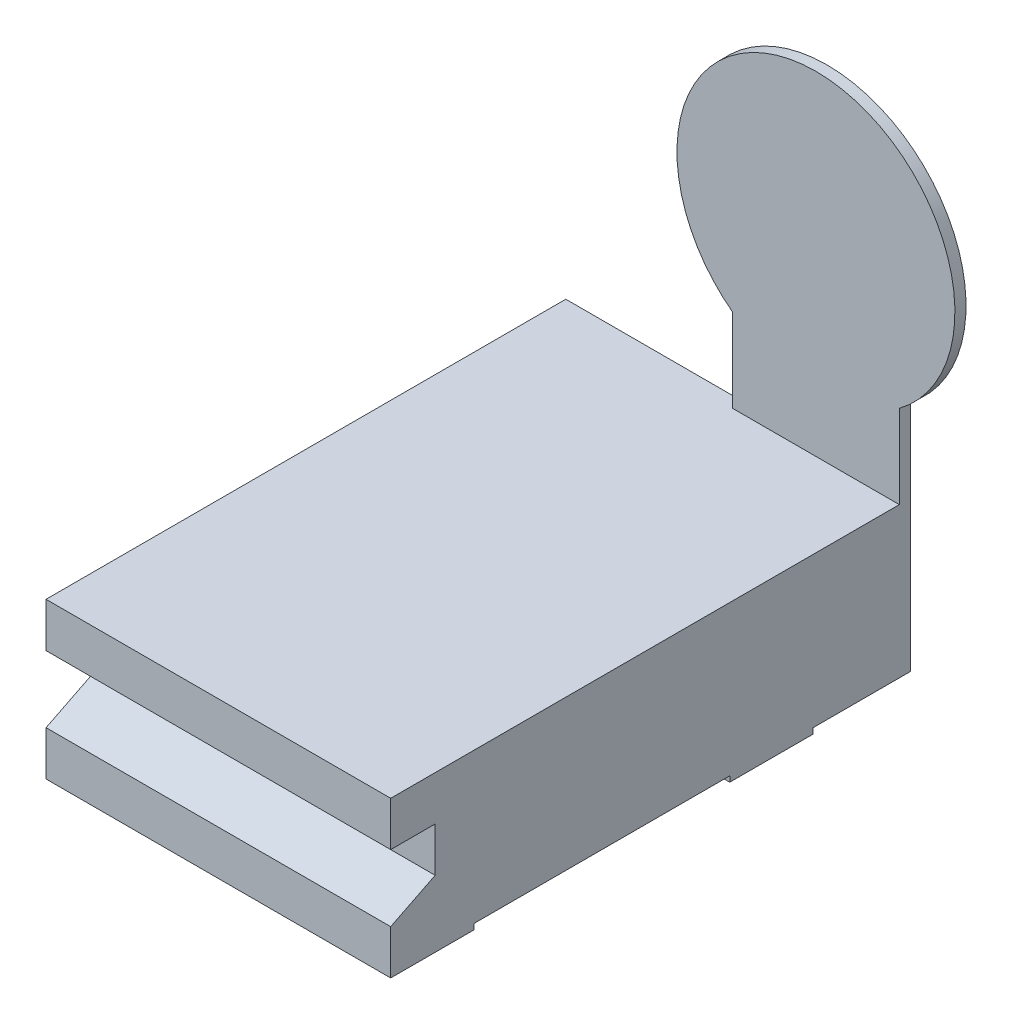
ISO-10303-21;
HEADER;
FILE_DESCRIPTION(('STEP AP214'),'2;1');
FILE_NAME('part.step','',(''),(''),'','','');
FILE_SCHEMA(('AUTOMOTIVE_DESIGN { 1 0 10303 214 1 1 1 1 }'));
ENDSEC;
DATA;
#1=APPLICATION_CONTEXT('core data for automotive mechanical design processes');
#2=APPLICATION_PROTOCOL_DEFINITION('international standard','automotive_design',2000,#1);
#3=PRODUCT_CONTEXT('',#1,'mechanical');
#4=PRODUCT('Part','Part','',(#3));
#5=PRODUCT_RELATED_PRODUCT_CATEGORY('part','',(#4));
#6=PRODUCT_DEFINITION_FORMATION('','',#4);
#7=PRODUCT_DEFINITION_CONTEXT('part definition',#1,'design');
#8=PRODUCT_DEFINITION('design','',#6,#7);
#9=PRODUCT_DEFINITION_SHAPE('','',#8);
#10=(LENGTH_UNIT() NAMED_UNIT(*) SI_UNIT(.MILLI.,.METRE.));
#11=(NAMED_UNIT(*) PLANE_ANGLE_UNIT() SI_UNIT($,.RADIAN.));
#12=(NAMED_UNIT(*) SI_UNIT($,.STERADIAN.) SOLID_ANGLE_UNIT());
#13=UNCERTAINTY_MEASURE_WITH_UNIT(LENGTH_MEASURE(1.E-05),#10,'distance_accuracy_value','');
#14=(GEOMETRIC_REPRESENTATION_CONTEXT(3) GLOBAL_UNCERTAINTY_ASSIGNED_CONTEXT((#13)) GLOBAL_UNIT_ASSIGNED_CONTEXT((#10,
#11,#12)) REPRESENTATION_CONTEXT('',''));
#15=CARTESIAN_POINT('',(0.,0.,0.));
#16=DIRECTION('',(0.,0.,1.));
#17=DIRECTION('',(1.,0.,0.));
#18=AXIS2_PLACEMENT_3D('',#15,#16,#17);
#19=CARTESIAN_POINT('',(-4.7,0.199999999999999,-4.25));
#20=DIRECTION('',(0.,0.,-1.));
#21=DIRECTION('',(-1.,0.,0.));
#22=AXIS2_PLACEMENT_3D('',#19,#20,#21);
#23=PLANE('',#22);
#24=DIRECTION('',(0.,1.,0.));
#25=VECTOR('',#24,1.);
#26=CARTESIAN_POINT('',(1.5,0.199999999999999,-4.25));
#27=LINE('',#26,#25);
#28=CARTESIAN_POINT('',(1.5,0.999999999999999,-4.25));
#29=VERTEX_POINT('',#28);
#30=CARTESIAN_POINT('',(1.5,0.199999999999999,-4.25));
#31=VERTEX_POINT('',#30);
#32=EDGE_CURVE('E353',#29,#31,#27,.F.);
#33=ORIENTED_EDGE('',*,*,#32,.F.);
#34=DIRECTION('',(1.,0.,0.));
#35=VECTOR('',#34,1.);
#36=CARTESIAN_POINT('',(-4.7,0.999999999999999,-4.25));
#37=LINE('',#36,#35);
#38=CARTESIAN_POINT('',(-4.7,0.999999999999999,-4.25));
#39=VERTEX_POINT('',#38);
#40=EDGE_CURVE('E333',#29,#39,#37,.F.);
#41=ORIENTED_EDGE('',*,*,#40,.T.);
#42=DIRECTION('',(0.,1.,0.));
#43=VECTOR('',#42,1.);
#44=CARTESIAN_POINT('',(-4.7,0.199999999999999,-4.25));
#45=LINE('',#44,#43);
#46=CARTESIAN_POINT('',(-4.7,0.199999999999999,-4.25));
#47=VERTEX_POINT('',#46);
#48=EDGE_CURVE('E368',#47,#39,#45,.T.);
#49=ORIENTED_EDGE('',*,*,#48,.F.);
#50=DIRECTION('',(1.,0.,0.));
#51=VECTOR('',#50,1.);
#52=CARTESIAN_POINT('',(-4.7,0.199999999999999,-4.25));
#53=LINE('',#52,#51);
#54=EDGE_CURVE('E327',#47,#31,#53,.T.);
#55=ORIENTED_EDGE('',*,*,#54,.T.);
#56=EDGE_LOOP('',(#33,#41,#49,#55));
#57=FACE_BOUND('',#56,.T.);
#58=ADVANCED_FACE('F17',(#57),#23,.F.);
#59=CARTESIAN_POINT('',(-4.7,0.999999999999999,-4.25));
#60=DIRECTION('',(0.,-0.894427190999916,-0.447213595499959));
#61=DIRECTION('',(0.,0.447213595499959,-0.894427190999916));
#62=AXIS2_PLACEMENT_3D('',#59,#60,#61);
#63=PLANE('',#62);
#64=DIRECTION('',(0.,0.447213595499959,-0.894427190999916));
#65=VECTOR('',#64,1.);
#66=CARTESIAN_POINT('',(1.5,0.999999999999999,-4.25));
#67=LINE('',#66,#65);
#68=CARTESIAN_POINT('',(1.5,1.4,-5.05));
#69=VERTEX_POINT('',#68);
#70=EDGE_CURVE('E347',#69,#29,#67,.F.);
#71=ORIENTED_EDGE('',*,*,#70,.F.);
#72=DIRECTION('',(-1.,0.,0.));
#73=VECTOR('',#72,1.);
#74=CARTESIAN_POINT('',(-4.7,1.4,-5.05));
#75=LINE('',#74,#73);
#76=CARTESIAN_POINT('',(-4.7,1.4,-5.05));
#77=VERTEX_POINT('',#76);
#78=EDGE_CURVE('E309',#69,#77,#75,.T.);
#79=ORIENTED_EDGE('',*,*,#78,.T.);
#80=DIRECTION('',(0.,0.447213595499959,-0.894427190999916));
#81=VECTOR('',#80,1.);
#82=CARTESIAN_POINT('',(-4.7,0.999999999999999,-4.25));
#83=LINE('',#82,#81);
#84=EDGE_CURVE('E350',#39,#77,#83,.T.);
#85=ORIENTED_EDGE('',*,*,#84,.F.);
#86=ORIENTED_EDGE('',*,*,#40,.F.);
#87=EDGE_LOOP('',(#71,#79,#85,#86));
#88=FACE_BOUND('',#87,.T.);
#89=ADVANCED_FACE('F374',(#88),#63,.F.);
#90=CARTESIAN_POINT('',(-4.7,0.199999999999999,-5.75));
#91=DIRECTION('',(0.,1.,0.));
#92=DIRECTION('',(0.,0.,1.));
#93=AXIS2_PLACEMENT_3D('',#90,#91,#92);
#94=PLANE('',#93);
#95=DIRECTION('',(0.,0.,1.));
#96=VECTOR('',#95,1.);
#97=CARTESIAN_POINT('',(1.5,0.199999999999999,-5.75));
#98=LINE('',#97,#96);
#99=CARTESIAN_POINT('',(1.5,0.199999999999999,-5.75));
#100=VERTEX_POINT('',#99);
#101=EDGE_CURVE('E324',#31,#100,#98,.F.);
#102=ORIENTED_EDGE('',*,*,#101,.F.);
#103=ORIENTED_EDGE('',*,*,#54,.F.);
#104=DIRECTION('',(0.,0.,1.));
#105=VECTOR('',#104,1.);
#106=CARTESIAN_POINT('',(-4.7,0.199999999999999,-5.75));
#107=LINE('',#106,#105);
#108=CARTESIAN_POINT('',(-4.7,0.199999999999999,-5.75));
#109=VERTEX_POINT('',#108);
#110=EDGE_CURVE('E330',#109,#47,#107,.T.);
#111=ORIENTED_EDGE('',*,*,#110,.F.);
#112=DIRECTION('',(1.,0.,0.));
#113=VECTOR('',#112,1.);
#114=CARTESIAN_POINT('',(-4.7,0.199999999999999,-5.75));
#115=LINE('',#114,#113);
#116=EDGE_CURVE('E298',#109,#100,#115,.T.);
#117=ORIENTED_EDGE('',*,*,#116,.T.);
#118=EDGE_LOOP('',(#102,#103,#111,#117));
#119=FACE_BOUND('',#118,.T.);
#120=ADVANCED_FACE('F430',(#119),#94,.F.);
#121=CARTESIAN_POINT('',(-4.7,0.199999999999999,-11.85));
#122=DIRECTION('',(0.,1.,0.));
#123=DIRECTION('',(0.,0.,1.));
#124=AXIS2_PLACEMENT_3D('',#121,#122,#123);
#125=PLANE('',#124);
#126=DIRECTION('',(0.,0.,1.));
#127=VECTOR('',#126,1.);
#128=CARTESIAN_POINT('',(1.5,0.199999999999999,-11.85));
#129=LINE('',#128,#127);
#130=CARTESIAN_POINT('',(1.5,0.199999999999999,-10.35));
#131=VERTEX_POINT('',#130);
#132=CARTESIAN_POINT('',(1.5,0.199999999999999,-11.85));
#133=VERTEX_POINT('',#132);
#134=EDGE_CURVE('E323',#131,#133,#129,.F.);
#135=ORIENTED_EDGE('',*,*,#134,.F.);
#136=DIRECTION('',(-1.,0.,0.));
#137=VECTOR('',#136,1.);
#138=CARTESIAN_POINT('',(-4.7,0.199999999999999,-10.35));
#139=LINE('',#138,#137);
#140=CARTESIAN_POINT('',(-4.7,0.199999999999999,-10.35));
#141=VERTEX_POINT('',#140);
#142=EDGE_CURVE('E294',#131,#141,#139,.T.);
#143=ORIENTED_EDGE('',*,*,#142,.T.);
#144=DIRECTION('',(0.,0.,1.));
#145=VECTOR('',#144,1.);
#146=CARTESIAN_POINT('',(-4.7,0.199999999999999,-11.85));
#147=LINE('',#146,#145);
#148=CARTESIAN_POINT('',(-4.7,0.199999999999999,-11.85));
#149=VERTEX_POINT('',#148);
#150=EDGE_CURVE('E326',#149,#141,#147,.T.);
#151=ORIENTED_EDGE('',*,*,#150,.F.);
#152=DIRECTION('',(1.,0.,0.));
#153=VECTOR('',#152,1.);
#154=CARTESIAN_POINT('',(-4.7,0.199999999999999,-11.85));
#155=LINE('',#154,#153);
#156=EDGE_CURVE('E308',#149,#133,#155,.T.);
#157=ORIENTED_EDGE('',*,*,#156,.T.);
#158=EDGE_LOOP('',(#135,#143,#151,#157));
#159=FACE_BOUND('',#158,.T.);
#160=ADVANCED_FACE('F403',(#159),#125,.F.);
#161=CARTESIAN_POINT('',(-4.7,1.4,-5.05));
#162=DIRECTION('',(0.,0.,-1.));
#163=DIRECTION('',(-1.,0.,0.));
#164=AXIS2_PLACEMENT_3D('',#161,#162,#163);
#165=PLANE('',#164);
#166=DIRECTION('',(0.,1.,0.));
#167=VECTOR('',#166,1.);
#168=CARTESIAN_POINT('',(1.5,1.4,-5.05));
#169=LINE('',#168,#167);
#170=CARTESIAN_POINT('',(1.5,2.2,-5.05));
#171=VERTEX_POINT('',#170);
#172=EDGE_CURVE('E317',#171,#69,#169,.F.);
#173=ORIENTED_EDGE('',*,*,#172,.F.);
#174=DIRECTION('',(1.,0.,0.));
#175=VECTOR('',#174,1.);
#176=CARTESIAN_POINT('',(-4.7,2.2,-5.05));
#177=LINE('',#176,#175);
#178=CARTESIAN_POINT('',(-4.7,2.2,-5.05));
#179=VERTEX_POINT('',#178);
#180=EDGE_CURVE('E285',#171,#179,#177,.F.);
#181=ORIENTED_EDGE('',*,*,#180,.T.);
#182=DIRECTION('',(0.,1.,0.));
#183=VECTOR('',#182,1.);
#184=CARTESIAN_POINT('',(-4.7,1.4,-5.05));
#185=LINE('',#184,#183);
#186=EDGE_CURVE('E320',#77,#179,#185,.T.);
#187=ORIENTED_EDGE('',*,*,#186,.F.);
#188=ORIENTED_EDGE('',*,*,#78,.F.);
#189=EDGE_LOOP('',(#173,#181,#187,#188));
#190=FACE_BOUND('',#189,.T.);
#191=ADVANCED_FACE('F381',(#190),#165,.F.);
#192=CARTESIAN_POINT('',(0.,6.5,-13.8));
#193=DIRECTION('',(0.,0.,-1.));
#194=DIRECTION('',(-1.,0.,0.));
#195=AXIS2_PLACEMENT_3D('',#192,#193,#194);
#196=PLANE('',#195);
#197=CARTESIAN_POINT('',(0.,6.5,-13.8));
#198=DIRECTION('',(0.,0.,-1.));
#199=DIRECTION('',(-1.,0.,0.));
#200=AXIS2_PLACEMENT_3D('',#197,#198,#199);
#201=CIRCLE('',#200,1.5);
#202=CARTESIAN_POINT('',(-1.5,6.5,-13.8));
#203=VERTEX_POINT('',#202);
#204=EDGE_CURVE('E20',#203,#203,#201,.F.);
#205=ORIENTED_EDGE('',*,*,#204,.F.);
#206=EDGE_LOOP('',(#205));
#207=FACE_BOUND('',#206,.T.);
#208=ADVANCED_FACE('F416',(#207),#196,.T.);
#209=CARTESIAN_POINT('',(-4.7,0.199999999999999,-11.85));
#210=DIRECTION('',(0.,0.,1.));
#211=DIRECTION('',(1.,0.,0.));
#212=AXIS2_PLACEMENT_3D('',#209,#210,#211);
#213=PLANE('',#212);
#214=DIRECTION('',(0.,1.,0.));
#215=VECTOR('',#214,1.);
#216=CARTESIAN_POINT('',(1.5,0.199999999999999,-11.85));
#217=LINE('',#216,#215);
#218=CARTESIAN_POINT('',(1.5,0.299999999999999,-11.85));
#219=VERTEX_POINT('',#218);
#220=EDGE_CURVE('E304',#133,#219,#217,.T.);
#221=ORIENTED_EDGE('',*,*,#220,.F.);
#222=ORIENTED_EDGE('',*,*,#156,.F.);
#223=DIRECTION('',(0.,1.,0.));
#224=VECTOR('',#223,1.);
#225=CARTESIAN_POINT('',(-4.7,0.199999999999999,-11.85));
#226=LINE('',#225,#224);
#227=CARTESIAN_POINT('',(-4.7,0.299999999999999,-11.85));
#228=VERTEX_POINT('',#227);
#229=EDGE_CURVE('E305',#228,#149,#226,.F.);
#230=ORIENTED_EDGE('',*,*,#229,.F.);
#231=DIRECTION('',(1.,0.,0.));
#232=VECTOR('',#231,1.);
#233=CARTESIAN_POINT('',(-4.7,0.299999999999999,-11.85));
#234=LINE('',#233,#232);
#235=EDGE_CURVE('E167',#228,#219,#234,.T.);
#236=ORIENTED_EDGE('',*,*,#235,.T.);
#237=EDGE_LOOP('',(#221,#222,#230,#236));
#238=FACE_BOUND('',#237,.T.);
#239=ADVANCED_FACE('F405',(#238),#213,.F.);
#240=CARTESIAN_POINT('',(-4.7,0.299999999999999,-5.75));
#241=DIRECTION('',(0.,0.,1.));
#242=DIRECTION('',(1.,0.,0.));
#243=AXIS2_PLACEMENT_3D('',#240,#241,#242);
#244=PLANE('',#243);
#245=DIRECTION('',(0.,1.,0.));
#246=VECTOR('',#245,1.);
#247=CARTESIAN_POINT('',(1.5,0.299999999999999,-5.75));
#248=LINE('',#247,#246);
#249=CARTESIAN_POINT('',(1.5,0.299999999999999,-5.75));
#250=VERTEX_POINT('',#249);
#251=EDGE_CURVE('E295',#100,#250,#248,.T.);
#252=ORIENTED_EDGE('',*,*,#251,.F.);
#253=ORIENTED_EDGE('',*,*,#116,.F.);
#254=DIRECTION('',(0.,1.,0.));
#255=VECTOR('',#254,1.);
#256=CARTESIAN_POINT('',(-4.7,0.299999999999999,-5.75));
#257=LINE('',#256,#255);
#258=CARTESIAN_POINT('',(-4.7,0.299999999999999,-5.75));
#259=VERTEX_POINT('',#258);
#260=EDGE_CURVE('E301',#259,#109,#257,.F.);
#261=ORIENTED_EDGE('',*,*,#260,.F.);
#262=DIRECTION('',(1.,0.,0.));
#263=VECTOR('',#262,1.);
#264=CARTESIAN_POINT('',(-4.7,0.299999999999999,-5.75));
#265=LINE('',#264,#263);
#266=EDGE_CURVE('E148',#259,#250,#265,.T.);
#267=ORIENTED_EDGE('',*,*,#266,.T.);
#268=EDGE_LOOP('',(#252,#253,#261,#267));
#269=FACE_BOUND('',#268,.T.);
#270=ADVANCED_FACE('F415',(#269),#244,.F.);
#271=CARTESIAN_POINT('',(-4.7,0.199999999999999,-10.35));
#272=DIRECTION('',(0.,0.,-1.));
#273=DIRECTION('',(-1.,0.,0.));
#274=AXIS2_PLACEMENT_3D('',#271,#272,#273);
#275=PLANE('',#274);
#276=DIRECTION('',(0.,1.,0.));
#277=VECTOR('',#276,1.);
#278=CARTESIAN_POINT('',(1.5,0.199999999999999,-10.35));
#279=LINE('',#278,#277);
#280=CARTESIAN_POINT('',(1.5,0.299999999999999,-10.35));
#281=VERTEX_POINT('',#280);
#282=EDGE_CURVE('E356',#281,#131,#279,.F.);
#283=ORIENTED_EDGE('',*,*,#282,.F.);
#284=DIRECTION('',(1.,0.,0.));
#285=VECTOR('',#284,1.);
#286=CARTESIAN_POINT('',(-4.7,0.299999999999999,-10.35));
#287=LINE('',#286,#285);
#288=CARTESIAN_POINT('',(-4.7,0.299999999999999,-10.35));
#289=VERTEX_POINT('',#288);
#290=EDGE_CURVE('E261',#281,#289,#287,.F.);
#291=ORIENTED_EDGE('',*,*,#290,.T.);
#292=DIRECTION('',(0.,1.,0.));
#293=VECTOR('',#292,1.);
#294=CARTESIAN_POINT('',(-4.7,0.199999999999999,-10.35));
#295=LINE('',#294,#293);
#296=EDGE_CURVE('E297',#141,#289,#295,.T.);
#297=ORIENTED_EDGE('',*,*,#296,.F.);
#298=ORIENTED_EDGE('',*,*,#142,.F.);
#299=EDGE_LOOP('',(#283,#291,#297,#298));
#300=FACE_BOUND('',#299,.T.);
#301=ADVANCED_FACE('F401',(#300),#275,.F.);
#302=CARTESIAN_POINT('',(-4.7,2.2,-5.05));
#303=DIRECTION('',(0.,1.,0.));
#304=DIRECTION('',(0.,0.,1.));
#305=AXIS2_PLACEMENT_3D('',#302,#303,#304);
#306=PLANE('',#305);
#307=DIRECTION('',(0.,0.,1.));
#308=VECTOR('',#307,1.);
#309=CARTESIAN_POINT('',(1.5,2.2,-5.05));
#310=LINE('',#309,#308);
#311=CARTESIAN_POINT('',(1.5,2.2,-4.25));
#312=VERTEX_POINT('',#311);
#313=EDGE_CURVE('E288',#312,#171,#310,.F.);
#314=ORIENTED_EDGE('',*,*,#313,.F.);
#315=DIRECTION('',(-1.,0.,0.));
#316=VECTOR('',#315,1.);
#317=CARTESIAN_POINT('',(-4.7,2.2,-4.25));
#318=LINE('',#317,#316);
#319=CARTESIAN_POINT('',(-4.7,2.2,-4.25));
#320=VERTEX_POINT('',#319);
#321=EDGE_CURVE('E259',#312,#320,#318,.T.);
#322=ORIENTED_EDGE('',*,*,#321,.T.);
#323=DIRECTION('',(0.,0.,1.));
#324=VECTOR('',#323,1.);
#325=CARTESIAN_POINT('',(-4.7,2.2,-5.05));
#326=LINE('',#325,#324);
#327=EDGE_CURVE('E291',#179,#320,#326,.T.);
#328=ORIENTED_EDGE('',*,*,#327,.F.);
#329=ORIENTED_EDGE('',*,*,#180,.F.);
#330=EDGE_LOOP('',(#314,#322,#328,#329));
#331=FACE_BOUND('',#330,.T.);
#332=ADVANCED_FACE('F182',(#331),#306,.F.);
#333=CARTESIAN_POINT('',(0.,3.6,-12.8));
#334=DIRECTION('',(0.70461373168455,0.657725816210263,0.266301032315154));
#335=DIRECTION('',(-0.160993293333398,-0.217322094714758,0.962731669080464));
#336=AXIS2_PLACEMENT_3D('',#333,#334,#335);
#337=SPHERICAL_SURFACE('',#336,1.);
#338=CARTESIAN_POINT('',(0.,4.2,-13.6));
#339=CARTESIAN_POINT('',(0.0337022647592783,4.19999850595183,-13.6));
#340=CARTESIAN_POINT('',(0.067428965640228,4.19715086814004,-13.6));
#341=CARTESIAN_POINT('',(0.133953520576813,4.18583057971137,-13.6));
#342=CARTESIAN_POINT('',(0.166750207125411,4.17735115912354,-13.6));
#343=CARTESIAN_POINT('',(0.230436078381926,4.15501055681906,-13.6));
#344=CARTESIAN_POINT('',(0.261326472661487,4.14115282927386,-13.6));
#345=CARTESIAN_POINT('',(0.320343878664361,4.10844690511288,-13.6));
#346=CARTESIAN_POINT('',(0.348470670280013,4.08959831143965,-13.5999999999999));
#347=CARTESIAN_POINT('',(0.401159139366278,4.04744765781754,-13.5999999999999));
#348=CARTESIAN_POINT('',(0.425721028563123,4.02414586254323,-13.6));
#349=CARTESIAN_POINT('',(0.470585059023389,3.97374849074156,-13.6));
#350=CARTESIAN_POINT('',(0.490887033007402,3.94665276530284,-13.5999999999999));
#351=CARTESIAN_POINT('',(0.526653945315504,3.8894371319871,-13.5999999999999));
#352=CARTESIAN_POINT('',(0.542118832639514,3.85931719222854,-13.6));
#353=CARTESIAN_POINT('',(0.567771454497815,3.79691032833781,-13.6));
#354=CARTESIAN_POINT('',(0.577959507429235,3.7646235350835,-13.5999999999999));
#355=CARTESIAN_POINT('',(0.592770922061467,3.69879677822995,-13.5999999999999));
#356=CARTESIAN_POINT('',(0.59739411082494,3.66525677571855,-13.6));
#357=CARTESIAN_POINT('',(0.600943973024148,3.59787671732463,-13.6));
#358=CARTESIAN_POINT('',(0.599870656724417,3.56403666198289,-13.5999999999999));
#359=CARTESIAN_POINT('',(0.592058001654443,3.49701704142911,-13.5999999999999));
#360=CARTESIAN_POINT('',(0.585318660769987,3.46383747646353,-13.6));
#361=CARTESIAN_POINT('',(0.566365252263633,3.39908068545964,-13.6));
#362=CARTESIAN_POINT('',(0.55415117886257,3.36750346111281,-13.6));
#363=CARTESIAN_POINT('',(0.524595031551339,3.30684778399681,-13.6));
#364=CARTESIAN_POINT('',(0.507252959309922,3.27776933041449,-13.6));
#365=CARTESIAN_POINT('',(0.467933110686125,3.22293664701894,-13.6));
#366=CARTESIAN_POINT('',(0.445955336180125,3.19718241586017,-13.6));
#367=CARTESIAN_POINT('',(0.397987960333663,3.14972924623481,-13.6));
#368=CARTESIAN_POINT('',(0.371998358443416,3.12803030832396,-13.6));
#369=CARTESIAN_POINT('',(0.316745094114601,3.08930369670711,-13.6));
#370=CARTESIAN_POINT('',(0.28748143124817,3.07227602361159,-13.6));
#371=CARTESIAN_POINT('',(0.226510758951737,3.04337531086907,-13.6));
#372=CARTESIAN_POINT('',(0.194803749626351,3.03150227100138,-13.6));
#373=CARTESIAN_POINT('',(0.12984645327551,3.01324786560722,-13.6));
#374=CARTESIAN_POINT('',(0.0965961663195825,3.00686649983335,-13.6));
#375=CARTESIAN_POINT('',(0.0294961913924016,2.99977658904295,-13.6));
#376=CARTESIAN_POINT('',(-0.00435349657885167,2.99906804402642,-13.6));
#377=CARTESIAN_POINT('',(-0.0716913820008496,3.00334388925286,-13.6));
#378=CARTESIAN_POINT('',(-0.105179579435309,3.00832827975231,-13.5999999999999));
#379=CARTESIAN_POINT('',(-0.17084385226689,3.02384850368122,-13.5999999999999));
#380=CARTESIAN_POINT('',(-0.203019927607832,3.03438433734839,-13.6));
#381=CARTESIAN_POINT('',(-0.265146566082099,3.06070836550135,-13.6));
#382=CARTESIAN_POINT('',(-0.29509712950626,3.07649655930075,-13.6));
#383=CARTESIAN_POINT('',(-0.351922536986204,3.11287712441218,-13.6));
#384=CARTESIAN_POINT('',(-0.378797381463486,3.13346949506583,-13.6));
#385=CARTESIAN_POINT('',(-0.42870846787585,3.17887386839364,-13.6));
#386=CARTESIAN_POINT('',(-0.45174470825719,3.20368587277576,-13.6));
#387=CARTESIAN_POINT('',(-0.493324649283792,3.25682517569279,-13.6));
#388=CARTESIAN_POINT('',(-0.511868348467093,3.28515247537165,-13.6));
#389=CARTESIAN_POINT('',(-0.543936777933706,3.34451820207209,-13.6));
#390=CARTESIAN_POINT('',(-0.557461513515064,3.37555662623176,-13.6));
#391=CARTESIAN_POINT('',(-0.579108113380049,3.43946352595863,-13.6));
#392=CARTESIAN_POINT('',(-0.587229979679695,3.47233200084295,-13.6));
#393=CARTESIAN_POINT('',(-0.597840301309204,3.53896603768387,-13.6));
#394=CARTESIAN_POINT('',(-0.600328746488179,3.57273160125681,-13.6));
#395=CARTESIAN_POINT('',(-0.599601571758382,3.64020019497398,-13.6));
#396=CARTESIAN_POINT('',(-0.596386129100364,3.67390322702882,-13.6));
#397=CARTESIAN_POINT('',(-0.584342421070431,3.74029315673022,-13.5999999999999));
#398=CARTESIAN_POINT('',(-0.575513816980107,3.772979992931,-13.5999999999998));
#399=CARTESIAN_POINT('',(-0.55249424760629,3.83640711755146,-13.5999999999998));
#400=CARTESIAN_POINT('',(-0.538303338859599,3.86714742649013,-13.6));
#401=CARTESIAN_POINT('',(-0.504962584828622,3.9258080643516,-13.6));
#402=CARTESIAN_POINT('',(-0.485812934250884,3.95372850393764,-13.6));
#403=CARTESIAN_POINT('',(-0.443097037425513,4.00595976405875,-13.6));
#404=CARTESIAN_POINT('',(-0.41953052881258,4.03027037001265,-13.6));
#405=CARTESIAN_POINT('',(-0.368651593708494,4.07458815029559,-13.6));
#406=CARTESIAN_POINT('',(-0.341339465445762,4.09459566691372,-13.6));
#407=CARTESIAN_POINT('',(-0.283728901532061,4.12975268093048,-13.6));
#408=CARTESIAN_POINT('',(-0.253428561130474,4.14489905322289,-13.6));
#409=CARTESIAN_POINT('',(-0.19073885699361,4.16987236567542,-13.6));
#410=CARTESIAN_POINT('',(-0.158352049843948,4.17970568231178,-13.6));
#411=CARTESIAN_POINT('',(-0.104799033155955,4.19115296648458,-13.6));
#412=CARTESIAN_POINT('',(-0.0839807996109744,4.19446646399484,-13.6));
#413=CARTESIAN_POINT('',(-0.0421115581474191,4.19889044756801,-13.6));
#414=CARTESIAN_POINT('',(-0.0210605502288447,4.20000093363093,-13.6));
#415=CARTESIAN_POINT('',(0.,4.2,-13.6));
#416=B_SPLINE_CURVE_WITH_KNOTS('',3,(#338,#339,#340,#341,#342,#343,#344,#345,#346,#347,#348,
#349,#350,#351,#352,#353,#354,#355,#356,#357,#358,#359,#360,#361,#362,#363,#364,#365,#366,#367,
#368,#369,#370,#371,#372,#373,#374,#375,#376,#377,#378,#379,#380,#381,#382,#383,#384,#385,#386,
#387,#388,#389,#390,#391,#392,#393,#394,#395,#396,#397,#398,#399,#400,#401,#402,#403,#404,#405,
#406,#407,#408,#409,#410,#411,#412,#413,#414,#415),.UNSPECIFIED.,.T.,.F.,(4,2,2,2,2,2,2,2,2,2,2,
2,2,2,2,2,2,2,2,2,2,2,2,2,2,2,2,2,2,2,2,2,2,2,2,2,2,2,4),(0.,0.101029924699421,
0.202181517903996,0.303268254582651,0.404363035818607,0.505451810386982,0.606544553791832,
0.707638363037418,0.808726071706949,0.909816921762768,1.01090758966302,1.11199829528411,
1.2130891076175,1.31417988705397,1.4152706255723,1.51636137794424,1.61745214352703,
1.71854290478152,1.81963366148178,1.92072441818205,2.02181517943654,2.12290594501932,
2.22399669739124,2.32508743590957,2.42617821534603,2.5272690276794,2.62835973330047,
2.72945040120069,2.8305412512565,2.93162895992591,3.03272276917134,3.13381551257632,
3.23490428714486,3.33599906838084,3.43708580505951,3.53823739826409,3.63926732296352,
3.70240093783914,3.76553455271477),.UNSPECIFIED.);
#417=CARTESIAN_POINT('',(0.,4.2,-13.6));
#418=VERTEX_POINT('',#417);
#419=EDGE_CURVE('E187',#418,#418,#416,.T.);
#420=ORIENTED_EDGE('',*,*,#419,.T.);
#421=EDGE_LOOP('',(#420));
#422=FACE_BOUND('',#421,.T.);
#423=ADVANCED_FACE('F176',(#422),#337,.T.);
#424=CARTESIAN_POINT('',(0.,6.5,-13.8));
#425=DIRECTION('',(0.,0.,-1.));
#426=DIRECTION('',(-1.,0.,0.));
#427=AXIS2_PLACEMENT_3D('',#424,#425,#426);
#428=CYLINDRICAL_SURFACE('',#427,1.5);
#429=CARTESIAN_POINT('',(0.,6.5,-13.6));
#430=DIRECTION('',(0.,0.,-1.));
#431=DIRECTION('',(-1.,0.,0.));
#432=AXIS2_PLACEMENT_3D('',#429,#430,#431);
#433=CIRCLE('',#432,1.5);
#434=CARTESIAN_POINT('',(-1.5,6.5,-13.6));
#435=VERTEX_POINT('',#434);
#436=EDGE_CURVE('E193',#435,#435,#433,.T.);
#437=ORIENTED_EDGE('',*,*,#436,.T.);
#438=EDGE_LOOP('',(#437));
#439=FACE_BOUND('',#438,.T.);
#440=ORIENTED_EDGE('',*,*,#204,.T.);
#441=EDGE_LOOP('',(#440));
#442=FACE_BOUND('',#441,.T.);
#443=ADVANCED_FACE('F181',(#439,#442),#428,.T.);
#444=CARTESIAN_POINT('',(-1.5,3.,-13.4));
#445=DIRECTION('',(-1.,0.,0.));
#446=DIRECTION('',(0.,0.,1.));
#447=AXIS2_PLACEMENT_3D('',#444,#445,#446);
#448=PLANE('',#447);
#449=DIRECTION('',(0.,1.,0.));
#450=VECTOR('',#449,1.);
#451=CARTESIAN_POINT('',(-1.5,6.5,-13.4));
#452=LINE('',#451,#450);
#453=CARTESIAN_POINT('',(-1.5,3.,-13.4));
#454=VERTEX_POINT('',#453);
#455=CARTESIAN_POINT('',(-1.5,4.5,-13.4));
#456=VERTEX_POINT('',#455);
#457=EDGE_CURVE('E240',#454,#456,#452,.T.);
#458=ORIENTED_EDGE('',*,*,#457,.T.);
#459=DIRECTION('',(0.,0.,1.));
#460=VECTOR('',#459,1.);
#461=CARTESIAN_POINT('',(-1.5,4.5,-13.4));
#462=LINE('',#461,#460);
#463=CARTESIAN_POINT('',(-1.5,4.5,-13.6));
#464=VERTEX_POINT('',#463);
#465=EDGE_CURVE('E123',#464,#456,#462,.T.);
#466=ORIENTED_EDGE('',*,*,#465,.F.);
#467=DIRECTION('',(0.,1.,0.));
#468=VECTOR('',#467,1.);
#469=CARTESIAN_POINT('',(-1.5,3.,-13.6));
#470=LINE('',#469,#468);
#471=CARTESIAN_POINT('',(-1.5,3.,-13.6));
#472=VERTEX_POINT('',#471);
#473=EDGE_CURVE('E134',#464,#472,#470,.F.);
#474=ORIENTED_EDGE('',*,*,#473,.T.);
#475=DIRECTION('',(0.,0.,1.));
#476=VECTOR('',#475,1.);
#477=CARTESIAN_POINT('',(-1.5,3.,-13.4));
#478=LINE('',#477,#476);
#479=EDGE_CURVE('E124',#472,#454,#478,.T.);
#480=ORIENTED_EDGE('',*,*,#479,.T.);
#481=EDGE_LOOP('',(#458,#466,#474,#480));
#482=FACE_BOUND('',#481,.T.);
#483=ADVANCED_FACE('F219',(#482),#448,.T.);
#484=CARTESIAN_POINT('',(0.,6.5,-13.4));
#485=DIRECTION('',(0.,0.,1.));
#486=DIRECTION('',(1.,0.,0.));
#487=AXIS2_PLACEMENT_3D('',#484,#485,#486);
#488=CYLINDRICAL_SURFACE('',#487,2.5);
#489=CARTESIAN_POINT('',(0.,6.5,-13.6));
#490=DIRECTION('',(0.,0.,1.));
#491=DIRECTION('',(1.,0.,0.));
#492=AXIS2_PLACEMENT_3D('',#489,#490,#491);
#493=CIRCLE('',#492,2.5);
#494=CARTESIAN_POINT('',(1.5,4.5,-13.6));
#495=VERTEX_POINT('',#494);
#496=EDGE_CURVE('E119',#495,#464,#493,.T.);
#497=ORIENTED_EDGE('',*,*,#496,.T.);
#498=ORIENTED_EDGE('',*,*,#465,.T.);
#499=CARTESIAN_POINT('',(0.,6.5,-13.4));
#500=DIRECTION('',(0.,0.,1.));
#501=DIRECTION('',(1.,0.,0.));
#502=AXIS2_PLACEMENT_3D('',#499,#500,#501);
#503=CIRCLE('',#502,2.5);
#504=CARTESIAN_POINT('',(1.5,4.5,-13.4));
#505=VERTEX_POINT('',#504);
#506=EDGE_CURVE('E121',#456,#505,#503,.F.);
#507=ORIENTED_EDGE('',*,*,#506,.T.);
#508=DIRECTION('',(0.,0.,1.));
#509=VECTOR('',#508,1.);
#510=CARTESIAN_POINT('',(1.5,4.5,-13.4));
#511=LINE('',#510,#509);
#512=EDGE_CURVE('E116',#505,#495,#511,.F.);
#513=ORIENTED_EDGE('',*,*,#512,.T.);
#514=EDGE_LOOP('',(#497,#498,#507,#513));
#515=FACE_BOUND('',#514,.T.);
#516=ADVANCED_FACE('F118',(#515),#488,.T.);
#517=CARTESIAN_POINT('',(-4.7,0.299999999999999,-13.6));
#518=DIRECTION('',(0.,1.,0.));
#519=DIRECTION('',(0.,0.,1.));
#520=AXIS2_PLACEMENT_3D('',#517,#518,#519);
#521=PLANE('',#520);
#522=DIRECTION('',(0.,0.,1.));
#523=VECTOR('',#522,1.);
#524=CARTESIAN_POINT('',(1.5,0.299999999999999,-4.25));
#525=LINE('',#524,#523);
#526=CARTESIAN_POINT('',(1.5,0.299999999999999,-13.6));
#527=VERTEX_POINT('',#526);
#528=EDGE_CURVE('E140',#527,#219,#525,.T.);
#529=ORIENTED_EDGE('',*,*,#528,.T.);
#530=ORIENTED_EDGE('',*,*,#235,.F.);
#531=DIRECTION('',(0.,0.,1.));
#532=VECTOR('',#531,1.);
#533=CARTESIAN_POINT('',(-4.7,0.299999999999999,-4.25));
#534=LINE('',#533,#532);
#535=CARTESIAN_POINT('',(-4.7,0.299999999999999,-13.6));
#536=VERTEX_POINT('',#535);
#537=EDGE_CURVE('E255',#536,#228,#534,.T.);
#538=ORIENTED_EDGE('',*,*,#537,.F.);
#539=DIRECTION('',(1.,0.,0.));
#540=VECTOR('',#539,1.);
#541=CARTESIAN_POINT('',(-4.7,0.299999999999999,-13.6));
#542=LINE('',#541,#540);
#543=EDGE_CURVE('E135',#536,#527,#542,.T.);
#544=ORIENTED_EDGE('',*,*,#543,.T.);
#545=EDGE_LOOP('',(#529,#530,#538,#544));
#546=FACE_BOUND('',#545,.T.);
#547=ADVANCED_FACE('F213',(#546),#521,.F.);
#548=CARTESIAN_POINT('',(-4.7,0.299999999999999,-10.35));
#549=DIRECTION('',(0.,1.,0.));
#550=DIRECTION('',(0.,0.,1.));
#551=AXIS2_PLACEMENT_3D('',#548,#549,#550);
#552=PLANE('',#551);
#553=DIRECTION('',(0.,0.,1.));
#554=VECTOR('',#553,1.);
#555=CARTESIAN_POINT('',(1.5,0.299999999999999,-4.25));
#556=LINE('',#555,#554);
#557=EDGE_CURVE('E142',#281,#250,#556,.T.);
#558=ORIENTED_EDGE('',*,*,#557,.T.);
#559=ORIENTED_EDGE('',*,*,#266,.F.);
#560=DIRECTION('',(0.,0.,1.));
#561=VECTOR('',#560,1.);
#562=CARTESIAN_POINT('',(-4.7,0.299999999999999,-4.25));
#563=LINE('',#562,#561);
#564=EDGE_CURVE('E252',#289,#259,#563,.T.);
#565=ORIENTED_EDGE('',*,*,#564,.F.);
#566=ORIENTED_EDGE('',*,*,#290,.F.);
#567=EDGE_LOOP('',(#558,#559,#565,#566));
#568=FACE_BOUND('',#567,.T.);
#569=ADVANCED_FACE('F209',(#568),#552,.F.);
#570=CARTESIAN_POINT('',(-4.7,2.2,-4.25));
#571=DIRECTION('',(0.,0.,-1.));
#572=DIRECTION('',(-1.,0.,0.));
#573=AXIS2_PLACEMENT_3D('',#570,#571,#572);
#574=PLANE('',#573);
#575=DIRECTION('',(0.,1.,0.));
#576=VECTOR('',#575,1.);
#577=CARTESIAN_POINT('',(1.5,0.199999999999999,-4.25));
#578=LINE('',#577,#576);
#579=CARTESIAN_POINT('',(1.5,3.,-4.25));
#580=VERTEX_POINT('',#579);
#581=EDGE_CURVE('E144',#312,#580,#578,.T.);
#582=ORIENTED_EDGE('',*,*,#581,.T.);
#583=DIRECTION('',(1.,0.,0.));
#584=VECTOR('',#583,1.);
#585=CARTESIAN_POINT('',(-4.7,3.,-4.25));
#586=LINE('',#585,#584);
#587=CARTESIAN_POINT('',(-4.7,3.,-4.25));
#588=VERTEX_POINT('',#587);
#589=EDGE_CURVE('E392',#580,#588,#586,.F.);
#590=ORIENTED_EDGE('',*,*,#589,.T.);
#591=DIRECTION('',(0.,1.,0.));
#592=VECTOR('',#591,1.);
#593=CARTESIAN_POINT('',(-4.7,0.199999999999999,-4.25));
#594=LINE('',#593,#592);
#595=EDGE_CURVE('E256',#320,#588,#594,.T.);
#596=ORIENTED_EDGE('',*,*,#595,.F.);
#597=ORIENTED_EDGE('',*,*,#321,.F.);
#598=EDGE_LOOP('',(#582,#590,#596,#597));
#599=FACE_BOUND('',#598,.T.);
#600=ADVANCED_FACE('F205',(#599),#574,.F.);
#601=CARTESIAN_POINT('',(-4.7,0.199999999999999,-4.25));
#602=DIRECTION('',(-1.,0.,0.));
#603=DIRECTION('',(0.,0.,1.));
#604=AXIS2_PLACEMENT_3D('',#601,#602,#603);
#605=PLANE('',#604);
#606=ORIENTED_EDGE('',*,*,#564,.T.);
#607=ORIENTED_EDGE('',*,*,#260,.T.);
#608=ORIENTED_EDGE('',*,*,#110,.T.);
#609=ORIENTED_EDGE('',*,*,#48,.T.);
#610=ORIENTED_EDGE('',*,*,#84,.T.);
#611=ORIENTED_EDGE('',*,*,#186,.T.);
#612=ORIENTED_EDGE('',*,*,#327,.T.);
#613=ORIENTED_EDGE('',*,*,#595,.T.);
#614=DIRECTION('',(0.,0.,-1.));
#615=VECTOR('',#614,1.);
#616=CARTESIAN_POINT('',(-4.7,3.,-4.25));
#617=LINE('',#616,#615);
#618=CARTESIAN_POINT('',(-4.7,3.,-13.6));
#619=VERTEX_POINT('',#618);
#620=EDGE_CURVE('E388',#588,#619,#617,.T.);
#621=ORIENTED_EDGE('',*,*,#620,.T.);
#622=DIRECTION('',(0.,1.,0.));
#623=VECTOR('',#622,1.);
#624=CARTESIAN_POINT('',(-4.7,3.,-13.6));
#625=LINE('',#624,#623);
#626=EDGE_CURVE('E153',#619,#536,#625,.F.);
#627=ORIENTED_EDGE('',*,*,#626,.T.);
#628=ORIENTED_EDGE('',*,*,#537,.T.);
#629=ORIENTED_EDGE('',*,*,#229,.T.);
#630=ORIENTED_EDGE('',*,*,#150,.T.);
#631=ORIENTED_EDGE('',*,*,#296,.T.);
#632=EDGE_LOOP('',(#606,#607,#608,#609,#610,#611,#612,#613,#621,#627,#628,#629,#630,#631));
#633=FACE_BOUND('',#632,.T.);
#634=ADVANCED_FACE('F200',(#633),#605,.T.);
#635=CARTESIAN_POINT('',(-4.7,3.,-13.6));
#636=DIRECTION('',(0.,0.,1.));
#637=DIRECTION('',(1.,0.,0.));
#638=AXIS2_PLACEMENT_3D('',#635,#636,#637);
#639=PLANE('',#638);
#640=ORIENTED_EDGE('',*,*,#436,.F.);
#641=EDGE_LOOP('',(#640));
#642=FACE_BOUND('',#641,.T.);
#643=ORIENTED_EDGE('',*,*,#419,.F.);
#644=EDGE_LOOP('',(#643));
#645=FACE_BOUND('',#644,.T.);
#646=ORIENTED_EDGE('',*,*,#473,.F.);
#647=ORIENTED_EDGE('',*,*,#496,.F.);
#648=DIRECTION('',(0.,1.,0.));
#649=VECTOR('',#648,1.);
#650=CARTESIAN_POINT('',(1.5,0.199999999999999,-13.6));
#651=LINE('',#650,#649);
#652=EDGE_CURVE('E131',#495,#527,#651,.F.);
#653=ORIENTED_EDGE('',*,*,#652,.T.);
#654=ORIENTED_EDGE('',*,*,#543,.F.);
#655=ORIENTED_EDGE('',*,*,#626,.F.);
#656=DIRECTION('',(1.,0.,0.));
#657=VECTOR('',#656,1.);
#658=CARTESIAN_POINT('',(-4.7,3.,-13.6));
#659=LINE('',#658,#657);
#660=EDGE_CURVE('E164',#619,#472,#659,.T.);
#661=ORIENTED_EDGE('',*,*,#660,.T.);
#662=EDGE_LOOP('',(#646,#647,#653,#654,#655,#661));
#663=FACE_BOUND('',#662,.T.);
#664=ADVANCED_FACE('F129',(#642,#645,#663),#639,.F.);
#665=CARTESIAN_POINT('',(0.,6.5,-13.4));
#666=DIRECTION('',(0.,0.,-1.));
#667=DIRECTION('',(-1.,0.,0.));
#668=AXIS2_PLACEMENT_3D('',#665,#666,#667);
#669=PLANE('',#668);
#670=DIRECTION('',(0.,1.,0.));
#671=VECTOR('',#670,1.);
#672=CARTESIAN_POINT('',(1.5,0.199999999999999,-13.4));
#673=LINE('',#672,#671);
#674=CARTESIAN_POINT('',(1.5,3.,-13.4));
#675=VERTEX_POINT('',#674);
#676=EDGE_CURVE('E34',#675,#505,#673,.T.);
#677=ORIENTED_EDGE('',*,*,#676,.T.);
#678=ORIENTED_EDGE('',*,*,#506,.F.);
#679=ORIENTED_EDGE('',*,*,#457,.F.);
#680=DIRECTION('',(1.,0.,0.));
#681=VECTOR('',#680,1.);
#682=CARTESIAN_POINT('',(-4.7,3.,-13.4));
#683=LINE('',#682,#681);
#684=EDGE_CURVE('E26',#454,#675,#683,.T.);
#685=ORIENTED_EDGE('',*,*,#684,.T.);
#686=EDGE_LOOP('',(#677,#678,#679,#685));
#687=FACE_BOUND('',#686,.T.);
#688=ADVANCED_FACE('F199',(#687),#669,.F.);
#689=CARTESIAN_POINT('',(1.5,0.199999999999999,-4.25));
#690=DIRECTION('',(-1.,0.,0.));
#691=DIRECTION('',(0.,0.,1.));
#692=AXIS2_PLACEMENT_3D('',#689,#690,#691);
#693=PLANE('',#692);
#694=ORIENTED_EDGE('',*,*,#251,.T.);
#695=ORIENTED_EDGE('',*,*,#557,.F.);
#696=ORIENTED_EDGE('',*,*,#282,.T.);
#697=ORIENTED_EDGE('',*,*,#134,.T.);
#698=ORIENTED_EDGE('',*,*,#220,.T.);
#699=ORIENTED_EDGE('',*,*,#528,.F.);
#700=ORIENTED_EDGE('',*,*,#652,.F.);
#701=ORIENTED_EDGE('',*,*,#512,.F.);
#702=ORIENTED_EDGE('',*,*,#676,.F.);
#703=DIRECTION('',(0.,0.,-1.));
#704=VECTOR('',#703,1.);
#705=CARTESIAN_POINT('',(1.5,3.,-4.25));
#706=LINE('',#705,#704);
#707=EDGE_CURVE('E11',#675,#580,#706,.F.);
#708=ORIENTED_EDGE('',*,*,#707,.T.);
#709=ORIENTED_EDGE('',*,*,#581,.F.);
#710=ORIENTED_EDGE('',*,*,#313,.T.);
#711=ORIENTED_EDGE('',*,*,#172,.T.);
#712=ORIENTED_EDGE('',*,*,#70,.T.);
#713=ORIENTED_EDGE('',*,*,#32,.T.);
#714=ORIENTED_EDGE('',*,*,#101,.T.);
#715=EDGE_LOOP('',(#694,#695,#696,#697,#698,#699,#700,#701,#702,#708,#709,#710,#711,#712,#713,#714));
#716=FACE_BOUND('',#715,.T.);
#717=ADVANCED_FACE('F138',(#716),#693,.F.);
#718=CARTESIAN_POINT('',(-4.7,3.,-4.25));
#719=DIRECTION('',(0.,-1.,0.));
#720=DIRECTION('',(0.,0.,-1.));
#721=AXIS2_PLACEMENT_3D('',#718,#719,#720);
#722=PLANE('',#721);
#723=ORIENTED_EDGE('',*,*,#684,.F.);
#724=ORIENTED_EDGE('',*,*,#479,.F.);
#725=ORIENTED_EDGE('',*,*,#660,.F.);
#726=ORIENTED_EDGE('',*,*,#620,.F.);
#727=ORIENTED_EDGE('',*,*,#589,.F.);
#728=ORIENTED_EDGE('',*,*,#707,.F.);
#729=EDGE_LOOP('',(#723,#724,#725,#726,#727,#728));
#730=FACE_BOUND('',#729,.T.);
#731=ADVANCED_FACE('F228',(#730),#722,.F.);
#732=CLOSED_SHELL('',(#58,#89,#120,#160,#191,#208,#239,#270,#301,#332,#423,#443,#483,#516,#547,
#569,#600,#634,#664,#688,#717,#731));
#733=MANIFOLD_SOLID_BREP('B1',#732);
#734=ADVANCED_BREP_SHAPE_REPRESENTATION('',(#18,#733),#14);
#735=SHAPE_DEFINITION_REPRESENTATION(#9,#734);
ENDSEC;
END-ISO-10303-21;
